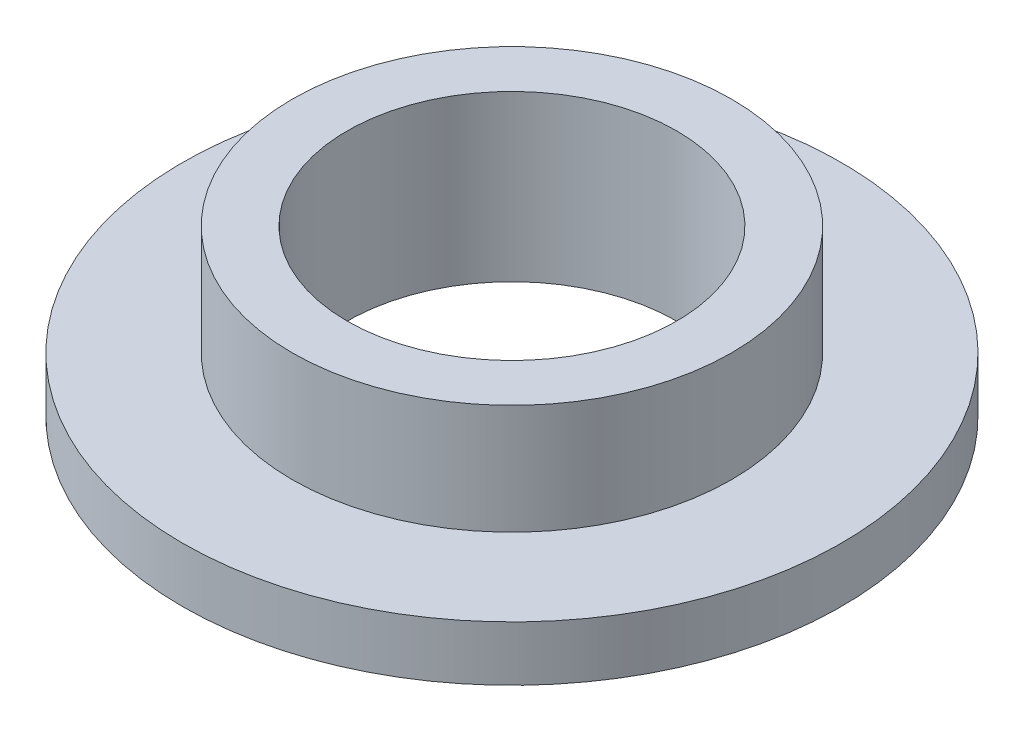
ISO-10303-21;
HEADER;
FILE_DESCRIPTION(('STEP AP214'),'2;1');
FILE_NAME('part.step','',(''),(''),'','','');
FILE_SCHEMA(('AUTOMOTIVE_DESIGN { 1 0 10303 214 1 1 1 1 }'));
ENDSEC;
DATA;
#1=APPLICATION_CONTEXT('core data for automotive mechanical design processes');
#2=APPLICATION_PROTOCOL_DEFINITION('international standard','automotive_design',2000,#1);
#3=PRODUCT_CONTEXT('',#1,'mechanical');
#4=PRODUCT('Part','Part','',(#3));
#5=PRODUCT_RELATED_PRODUCT_CATEGORY('part','',(#4));
#6=PRODUCT_DEFINITION_FORMATION('','',#4);
#7=PRODUCT_DEFINITION_CONTEXT('part definition',#1,'design');
#8=PRODUCT_DEFINITION('design','',#6,#7);
#9=PRODUCT_DEFINITION_SHAPE('','',#8);
#10=(LENGTH_UNIT() NAMED_UNIT(*) SI_UNIT(.MILLI.,.METRE.));
#11=(NAMED_UNIT(*) PLANE_ANGLE_UNIT() SI_UNIT($,.RADIAN.));
#12=(NAMED_UNIT(*) SI_UNIT($,.STERADIAN.) SOLID_ANGLE_UNIT());
#13=UNCERTAINTY_MEASURE_WITH_UNIT(LENGTH_MEASURE(1.E-05),#10,'distance_accuracy_value','');
#14=(GEOMETRIC_REPRESENTATION_CONTEXT(3) GLOBAL_UNCERTAINTY_ASSIGNED_CONTEXT((#13)) GLOBAL_UNIT_ASSIGNED_CONTEXT((#10,
#11,#12)) REPRESENTATION_CONTEXT('',''));
#15=CARTESIAN_POINT('',(0.,0.,0.));
#16=DIRECTION('',(0.,0.,1.));
#17=DIRECTION('',(1.,0.,0.));
#18=AXIS2_PLACEMENT_3D('',#15,#16,#17);
#19=CARTESIAN_POINT('',(0.,3.175,0.));
#20=DIRECTION('',(0.,-1.,0.));
#21=DIRECTION('',(0.,0.,-1.));
#22=AXIS2_PLACEMENT_3D('',#19,#20,#21);
#23=CYLINDRICAL_SURFACE('',#22,19.05);
#24=CARTESIAN_POINT('',(0.,3.175,0.));
#25=DIRECTION('',(0.,1.,0.));
#26=DIRECTION('',(0.,0.,1.));
#27=AXIS2_PLACEMENT_3D('',#24,#25,#26);
#28=CIRCLE('',#27,19.05);
#29=CARTESIAN_POINT('',(0.,3.175,19.05));
#30=VERTEX_POINT('',#29);
#31=EDGE_CURVE('E10',#30,#30,#28,.T.);
#32=ORIENTED_EDGE('',*,*,#31,.F.);
#33=EDGE_LOOP('',(#32));
#34=FACE_BOUND('',#33,.T.);
#35=CARTESIAN_POINT('',(0.,0.,0.));
#36=DIRECTION('',(0.,1.,0.));
#37=DIRECTION('',(0.,0.,1.));
#38=AXIS2_PLACEMENT_3D('',#35,#36,#37);
#39=CIRCLE('',#38,19.05);
#40=CARTESIAN_POINT('',(0.,0.,19.05));
#41=VERTEX_POINT('',#40);
#42=EDGE_CURVE('E35',#41,#41,#39,.T.);
#43=ORIENTED_EDGE('',*,*,#42,.T.);
#44=EDGE_LOOP('',(#43));
#45=FACE_BOUND('',#44,.T.);
#46=ADVANCED_FACE('F32',(#34,#45),#23,.T.);
#47=CARTESIAN_POINT('',(0.,3.175,0.));
#48=DIRECTION('',(0.,1.,0.));
#49=DIRECTION('',(0.,0.,1.));
#50=AXIS2_PLACEMENT_3D('',#47,#48,#49);
#51=PLANE('',#50);
#52=CARTESIAN_POINT('',(0.,3.175,0.));
#53=DIRECTION('',(0.,1.,0.));
#54=DIRECTION('',(0.,0.,1.));
#55=AXIS2_PLACEMENT_3D('',#52,#53,#54);
#56=CIRCLE('',#55,12.7);
#57=CARTESIAN_POINT('',(0.,3.175,12.7));
#58=VERTEX_POINT('',#57);
#59=EDGE_CURVE('E44',#58,#58,#56,.T.);
#60=ORIENTED_EDGE('',*,*,#59,.F.);
#61=EDGE_LOOP('',(#60));
#62=FACE_BOUND('',#61,.T.);
#63=ORIENTED_EDGE('',*,*,#31,.T.);
#64=EDGE_LOOP('',(#63));
#65=FACE_BOUND('',#64,.T.);
#66=ADVANCED_FACE('F77',(#62,#65),#51,.T.);
#67=CARTESIAN_POINT('',(0.,0.,0.));
#68=DIRECTION('',(0.,1.,0.));
#69=DIRECTION('',(0.,0.,1.));
#70=AXIS2_PLACEMENT_3D('',#67,#68,#69);
#71=PLANE('',#70);
#72=CARTESIAN_POINT('',(0.,0.,0.));
#73=DIRECTION('',(0.,1.,0.));
#74=DIRECTION('',(0.,0.,1.));
#75=AXIS2_PLACEMENT_3D('',#72,#73,#74);
#76=CIRCLE('',#75,9.525);
#77=CARTESIAN_POINT('',(0.,0.,9.525));
#78=VERTEX_POINT('',#77);
#79=EDGE_CURVE('E47',#78,#78,#76,.T.);
#80=ORIENTED_EDGE('',*,*,#79,.T.);
#81=EDGE_LOOP('',(#80));
#82=FACE_BOUND('',#81,.T.);
#83=ORIENTED_EDGE('',*,*,#42,.F.);
#84=EDGE_LOOP('',(#83));
#85=FACE_BOUND('',#84,.T.);
#86=ADVANCED_FACE('F56',(#82,#85),#71,.F.);
#87=CARTESIAN_POINT('',(0.,9.525,0.));
#88=DIRECTION('',(0.,-1.,0.));
#89=DIRECTION('',(0.,0.,-1.));
#90=AXIS2_PLACEMENT_3D('',#87,#88,#89);
#91=CYLINDRICAL_SURFACE('',#90,12.7);
#92=CARTESIAN_POINT('',(0.,9.525,0.));
#93=DIRECTION('',(0.,1.,0.));
#94=DIRECTION('',(0.,0.,1.));
#95=AXIS2_PLACEMENT_3D('',#92,#93,#94);
#96=CIRCLE('',#95,12.7);
#97=CARTESIAN_POINT('',(0.,9.525,12.7));
#98=VERTEX_POINT('',#97);
#99=EDGE_CURVE('E42',#98,#98,#96,.T.);
#100=ORIENTED_EDGE('',*,*,#99,.F.);
#101=EDGE_LOOP('',(#100));
#102=FACE_BOUND('',#101,.T.);
#103=ORIENTED_EDGE('',*,*,#59,.T.);
#104=EDGE_LOOP('',(#103));
#105=FACE_BOUND('',#104,.T.);
#106=ADVANCED_FACE('F68',(#102,#105),#91,.T.);
#107=CARTESIAN_POINT('',(0.,9.525,0.));
#108=DIRECTION('',(0.,1.,0.));
#109=DIRECTION('',(0.,0.,1.));
#110=AXIS2_PLACEMENT_3D('',#107,#108,#109);
#111=PLANE('',#110);
#112=CARTESIAN_POINT('',(0.,9.525,0.));
#113=DIRECTION('',(0.,1.,0.));
#114=DIRECTION('',(0.,0.,1.));
#115=AXIS2_PLACEMENT_3D('',#112,#113,#114);
#116=CIRCLE('',#115,9.525);
#117=CARTESIAN_POINT('',(0.,9.525,9.525));
#118=VERTEX_POINT('',#117);
#119=EDGE_CURVE('E50',#118,#118,#116,.T.);
#120=ORIENTED_EDGE('',*,*,#119,.F.);
#121=EDGE_LOOP('',(#120));
#122=FACE_BOUND('',#121,.T.);
#123=ORIENTED_EDGE('',*,*,#99,.T.);
#124=EDGE_LOOP('',(#123));
#125=FACE_BOUND('',#124,.T.);
#126=ADVANCED_FACE('F62',(#122,#125),#111,.T.);
#127=CARTESIAN_POINT('',(0.,0.,0.));
#128=DIRECTION('',(0.,1.,0.));
#129=DIRECTION('',(0.,0.,1.));
#130=AXIS2_PLACEMENT_3D('',#127,#128,#129);
#131=CYLINDRICAL_SURFACE('',#130,9.525);
#132=ORIENTED_EDGE('',*,*,#79,.F.);
#133=EDGE_LOOP('',(#132));
#134=FACE_BOUND('',#133,.T.);
#135=ORIENTED_EDGE('',*,*,#119,.T.);
#136=EDGE_LOOP('',(#135));
#137=FACE_BOUND('',#136,.T.);
#138=ADVANCED_FACE('F59',(#134,#137),#131,.F.);
#139=CLOSED_SHELL('',(#46,#66,#86,#106,#126,#138));
#140=MANIFOLD_SOLID_BREP('B2',#139);
#141=ADVANCED_BREP_SHAPE_REPRESENTATION('',(#18,#140),#14);
#142=SHAPE_DEFINITION_REPRESENTATION(#9,#141);
ENDSEC;
END-ISO-10303-21;
